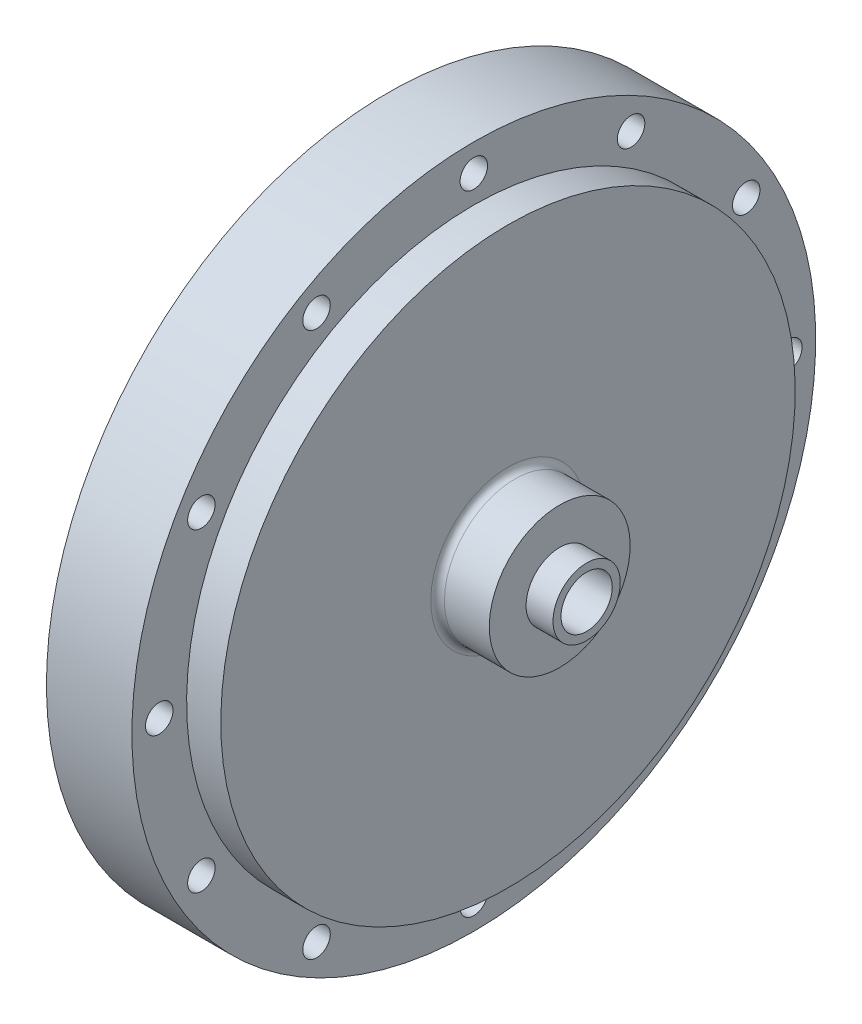
ISO-10303-21;
HEADER;
FILE_DESCRIPTION(('STEP AP214'),'2;1');
FILE_NAME('part.step','',(''),(''),'','','');
FILE_SCHEMA(('AUTOMOTIVE_DESIGN { 1 0 10303 214 1 1 1 1 }'));
ENDSEC;
DATA;
#1=APPLICATION_CONTEXT('core data for automotive mechanical design processes');
#2=APPLICATION_PROTOCOL_DEFINITION('international standard','automotive_design',2000,#1);
#3=PRODUCT_CONTEXT('',#1,'mechanical');
#4=PRODUCT('Part','Part','',(#3));
#5=PRODUCT_RELATED_PRODUCT_CATEGORY('part','',(#4));
#6=PRODUCT_DEFINITION_FORMATION('','',#4);
#7=PRODUCT_DEFINITION_CONTEXT('part definition',#1,'design');
#8=PRODUCT_DEFINITION('design','',#6,#7);
#9=PRODUCT_DEFINITION_SHAPE('','',#8);
#10=(LENGTH_UNIT() NAMED_UNIT(*) SI_UNIT(.MILLI.,.METRE.));
#11=(NAMED_UNIT(*) PLANE_ANGLE_UNIT() SI_UNIT($,.RADIAN.));
#12=(NAMED_UNIT(*) SI_UNIT($,.STERADIAN.) SOLID_ANGLE_UNIT());
#13=UNCERTAINTY_MEASURE_WITH_UNIT(LENGTH_MEASURE(1.E-05),#10,'distance_accuracy_value','');
#14=(GEOMETRIC_REPRESENTATION_CONTEXT(3) GLOBAL_UNCERTAINTY_ASSIGNED_CONTEXT((#13)) GLOBAL_UNIT_ASSIGNED_CONTEXT((#10,
#11,#12)) REPRESENTATION_CONTEXT('',''));
#15=CARTESIAN_POINT('',(0.,0.,0.));
#16=DIRECTION('',(0.,0.,1.));
#17=DIRECTION('',(1.,0.,0.));
#18=AXIS2_PLACEMENT_3D('',#15,#16,#17);
#19=CARTESIAN_POINT('',(31.75,63.5,0.));
#20=DIRECTION('',(-1.,0.,0.));
#21=DIRECTION('',(0.,-1.,0.));
#22=AXIS2_PLACEMENT_3D('',#19,#20,#21);
#23=PLANE('',#22);
#24=CARTESIAN_POINT('',(31.75,0.,0.));
#25=DIRECTION('',(-1.,0.,0.));
#26=DIRECTION('',(0.,-1.,0.));
#27=AXIS2_PLACEMENT_3D('',#24,#25,#26);
#28=CIRCLE('',#27,14.351);
#29=CARTESIAN_POINT('',(31.75,-14.351,0.));
#30=VERTEX_POINT('',#29);
#31=EDGE_CURVE('E210',#30,#30,#28,.T.);
#32=ORIENTED_EDGE('',*,*,#31,.T.);
#33=EDGE_LOOP('',(#32));
#34=FACE_BOUND('',#33,.T.);
#35=CARTESIAN_POINT('',(31.75,0.,0.));
#36=DIRECTION('',(1.,0.,0.));
#37=DIRECTION('',(0.,1.,0.));
#38=AXIS2_PLACEMENT_3D('',#35,#36,#37);
#39=CIRCLE('',#38,53.34);
#40=CARTESIAN_POINT('',(31.75,53.34,0.));
#41=VERTEX_POINT('',#40);
#42=EDGE_CURVE('E233',#41,#41,#39,.T.);
#43=ORIENTED_EDGE('',*,*,#42,.T.);
#44=EDGE_LOOP('',(#43));
#45=FACE_BOUND('',#44,.T.);
#46=ADVANCED_FACE('F48',(#34,#45),#23,.F.);
#47=CARTESIAN_POINT('',(9.525,0.,0.));
#48=DIRECTION('',(-1.,0.,0.));
#49=DIRECTION('',(0.,-1.,0.));
#50=AXIS2_PLACEMENT_3D('',#47,#48,#49);
#51=CYLINDRICAL_SURFACE('',#50,63.5);
#52=CARTESIAN_POINT('',(9.525,0.,0.));
#53=DIRECTION('',(-1.,0.,0.));
#54=DIRECTION('',(0.,-1.,0.));
#55=AXIS2_PLACEMENT_3D('',#52,#53,#54);
#56=CIRCLE('',#55,63.5);
#57=CARTESIAN_POINT('',(9.525,-63.5,0.));
#58=VERTEX_POINT('',#57);
#59=EDGE_CURVE('E418',#58,#58,#56,.T.);
#60=ORIENTED_EDGE('',*,*,#59,.F.);
#61=EDGE_LOOP('',(#60));
#62=FACE_BOUND('',#61,.T.);
#63=CARTESIAN_POINT('',(25.4,0.,0.));
#64=DIRECTION('',(1.,0.,0.));
#65=DIRECTION('',(0.,1.,0.));
#66=AXIS2_PLACEMENT_3D('',#63,#64,#65);
#67=CIRCLE('',#66,63.5);
#68=CARTESIAN_POINT('',(25.4,63.5,0.));
#69=VERTEX_POINT('',#68);
#70=EDGE_CURVE('E109',#69,#69,#67,.T.);
#71=ORIENTED_EDGE('',*,*,#70,.F.);
#72=EDGE_LOOP('',(#71));
#73=FACE_BOUND('',#72,.T.);
#74=ADVANCED_FACE('F229',(#62,#73),#51,.T.);
#75=CARTESIAN_POINT('',(31.75,-50.5932040890869,29.21));
#76=DIRECTION('',(1.,0.,0.));
#77=DIRECTION('',(0.,0.,-1.));
#78=AXIS2_PLACEMENT_3D('',#75,#76,#77);
#79=CYLINDRICAL_SURFACE('',#78,2.5527);
#80=CARTESIAN_POINT('',(9.525,-50.5932040890869,29.21));
#81=DIRECTION('',(1.,0.,0.));
#82=DIRECTION('',(0.,1.,0.));
#83=AXIS2_PLACEMENT_3D('',#80,#81,#82);
#84=CIRCLE('',#83,2.5527);
#85=CARTESIAN_POINT('',(9.525,-48.0405040890869,29.21));
#86=VERTEX_POINT('',#85);
#87=EDGE_CURVE('E410',#86,#86,#84,.T.);
#88=ORIENTED_EDGE('',*,*,#87,.F.);
#89=EDGE_LOOP('',(#88));
#90=FACE_BOUND('',#89,.T.);
#91=CARTESIAN_POINT('',(25.4,-50.5932040890869,29.21));
#92=DIRECTION('',(1.,0.,0.));
#93=DIRECTION('',(0.,1.,0.));
#94=AXIS2_PLACEMENT_3D('',#91,#92,#93);
#95=CIRCLE('',#94,2.5527);
#96=CARTESIAN_POINT('',(25.4,-48.0405040890869,29.21));
#97=VERTEX_POINT('',#96);
#98=EDGE_CURVE('E282',#97,#97,#95,.F.);
#99=ORIENTED_EDGE('',*,*,#98,.F.);
#100=EDGE_LOOP('',(#99));
#101=FACE_BOUND('',#100,.T.);
#102=ADVANCED_FACE('F291',(#90,#101),#79,.F.);
#103=CARTESIAN_POINT('',(31.75,-29.21,50.5932040890869));
#104=DIRECTION('',(1.,0.,0.));
#105=DIRECTION('',(0.,0.,-1.));
#106=AXIS2_PLACEMENT_3D('',#103,#104,#105);
#107=CYLINDRICAL_SURFACE('',#106,2.5527);
#108=CARTESIAN_POINT('',(9.525,-29.21,50.5932040890869));
#109=DIRECTION('',(1.,0.,0.));
#110=DIRECTION('',(0.,1.,0.));
#111=AXIS2_PLACEMENT_3D('',#108,#109,#110);
#112=CIRCLE('',#111,2.5527);
#113=CARTESIAN_POINT('',(9.525,-26.6573,50.5932040890869));
#114=VERTEX_POINT('',#113);
#115=EDGE_CURVE('E406',#114,#114,#112,.T.);
#116=ORIENTED_EDGE('',*,*,#115,.F.);
#117=EDGE_LOOP('',(#116));
#118=FACE_BOUND('',#117,.T.);
#119=CARTESIAN_POINT('',(25.4,-29.21,50.5932040890869));
#120=DIRECTION('',(1.,0.,0.));
#121=DIRECTION('',(0.,1.,0.));
#122=AXIS2_PLACEMENT_3D('',#119,#120,#121);
#123=CIRCLE('',#122,2.5527);
#124=CARTESIAN_POINT('',(25.4,-26.6573,50.5932040890869));
#125=VERTEX_POINT('',#124);
#126=EDGE_CURVE('E278',#125,#125,#123,.F.);
#127=ORIENTED_EDGE('',*,*,#126,.F.);
#128=EDGE_LOOP('',(#127));
#129=FACE_BOUND('',#128,.T.);
#130=ADVANCED_FACE('F296',(#118,#129),#107,.F.);
#131=CARTESIAN_POINT('',(31.75,0.,58.42));
#132=DIRECTION('',(1.,0.,0.));
#133=DIRECTION('',(0.,0.,-1.));
#134=AXIS2_PLACEMENT_3D('',#131,#132,#133);
#135=CYLINDRICAL_SURFACE('',#134,2.5527);
#136=CARTESIAN_POINT('',(9.525,0.,58.42));
#137=DIRECTION('',(1.,0.,0.));
#138=DIRECTION('',(0.,1.,0.));
#139=AXIS2_PLACEMENT_3D('',#136,#137,#138);
#140=CIRCLE('',#139,2.5527);
#141=CARTESIAN_POINT('',(9.525,2.5527,58.42));
#142=VERTEX_POINT('',#141);
#143=EDGE_CURVE('E402',#142,#142,#140,.T.);
#144=ORIENTED_EDGE('',*,*,#143,.F.);
#145=EDGE_LOOP('',(#144));
#146=FACE_BOUND('',#145,.T.);
#147=CARTESIAN_POINT('',(25.4,0.,58.42));
#148=DIRECTION('',(1.,0.,0.));
#149=DIRECTION('',(0.,1.,0.));
#150=AXIS2_PLACEMENT_3D('',#147,#148,#149);
#151=CIRCLE('',#150,2.5527);
#152=CARTESIAN_POINT('',(25.4,2.5527,58.42));
#153=VERTEX_POINT('',#152);
#154=EDGE_CURVE('E274',#153,#153,#151,.F.);
#155=ORIENTED_EDGE('',*,*,#154,.F.);
#156=EDGE_LOOP('',(#155));
#157=FACE_BOUND('',#156,.T.);
#158=ADVANCED_FACE('F826',(#146,#157),#135,.F.);
#159=CARTESIAN_POINT('',(31.75,29.21,50.5932040890869));
#160=DIRECTION('',(1.,0.,0.));
#161=DIRECTION('',(0.,0.,-1.));
#162=AXIS2_PLACEMENT_3D('',#159,#160,#161);
#163=CYLINDRICAL_SURFACE('',#162,2.5527);
#164=CARTESIAN_POINT('',(9.525,29.21,50.5932040890869));
#165=DIRECTION('',(1.,0.,0.));
#166=DIRECTION('',(0.,1.,0.));
#167=AXIS2_PLACEMENT_3D('',#164,#165,#166);
#168=CIRCLE('',#167,2.5527);
#169=CARTESIAN_POINT('',(9.525,31.7627,50.5932040890869));
#170=VERTEX_POINT('',#169);
#171=EDGE_CURVE('E398',#170,#170,#168,.T.);
#172=ORIENTED_EDGE('',*,*,#171,.F.);
#173=EDGE_LOOP('',(#172));
#174=FACE_BOUND('',#173,.T.);
#175=CARTESIAN_POINT('',(25.4,29.21,50.5932040890869));
#176=DIRECTION('',(1.,0.,0.));
#177=DIRECTION('',(0.,1.,0.));
#178=AXIS2_PLACEMENT_3D('',#175,#176,#177);
#179=CIRCLE('',#178,2.5527);
#180=CARTESIAN_POINT('',(25.4,31.7627,50.5932040890869));
#181=VERTEX_POINT('',#180);
#182=EDGE_CURVE('E270',#181,#181,#179,.F.);
#183=ORIENTED_EDGE('',*,*,#182,.F.);
#184=EDGE_LOOP('',(#183));
#185=FACE_BOUND('',#184,.T.);
#186=ADVANCED_FACE('F834',(#174,#185),#163,.F.);
#187=CARTESIAN_POINT('',(31.75,50.5932040890869,29.21));
#188=DIRECTION('',(1.,0.,0.));
#189=DIRECTION('',(0.,0.,-1.));
#190=AXIS2_PLACEMENT_3D('',#187,#188,#189);
#191=CYLINDRICAL_SURFACE('',#190,2.5527);
#192=CARTESIAN_POINT('',(9.525,50.5932040890869,29.21));
#193=DIRECTION('',(1.,0.,0.));
#194=DIRECTION('',(0.,1.,0.));
#195=AXIS2_PLACEMENT_3D('',#192,#193,#194);
#196=CIRCLE('',#195,2.5527);
#197=CARTESIAN_POINT('',(9.525,53.1459040890869,29.21));
#198=VERTEX_POINT('',#197);
#199=EDGE_CURVE('E394',#198,#198,#196,.T.);
#200=ORIENTED_EDGE('',*,*,#199,.F.);
#201=EDGE_LOOP('',(#200));
#202=FACE_BOUND('',#201,.T.);
#203=CARTESIAN_POINT('',(25.4,50.5932040890869,29.21));
#204=DIRECTION('',(1.,0.,0.));
#205=DIRECTION('',(0.,1.,0.));
#206=AXIS2_PLACEMENT_3D('',#203,#204,#205);
#207=CIRCLE('',#206,2.5527);
#208=CARTESIAN_POINT('',(25.4,53.1459040890869,29.21));
#209=VERTEX_POINT('',#208);
#210=EDGE_CURVE('E266',#209,#209,#207,.F.);
#211=ORIENTED_EDGE('',*,*,#210,.F.);
#212=EDGE_LOOP('',(#211));
#213=FACE_BOUND('',#212,.T.);
#214=ADVANCED_FACE('F843',(#202,#213),#191,.F.);
#215=CARTESIAN_POINT('',(31.75,58.42,0.));
#216=DIRECTION('',(1.,0.,0.));
#217=DIRECTION('',(0.,0.,-1.));
#218=AXIS2_PLACEMENT_3D('',#215,#216,#217);
#219=CYLINDRICAL_SURFACE('',#218,2.5527);
#220=CARTESIAN_POINT('',(9.525,58.42,0.));
#221=DIRECTION('',(1.,0.,0.));
#222=DIRECTION('',(0.,1.,0.));
#223=AXIS2_PLACEMENT_3D('',#220,#221,#222);
#224=CIRCLE('',#223,2.5527);
#225=CARTESIAN_POINT('',(9.525,60.9727,0.));
#226=VERTEX_POINT('',#225);
#227=EDGE_CURVE('E390',#226,#226,#224,.T.);
#228=ORIENTED_EDGE('',*,*,#227,.F.);
#229=EDGE_LOOP('',(#228));
#230=FACE_BOUND('',#229,.T.);
#231=CARTESIAN_POINT('',(25.4,58.42,0.));
#232=DIRECTION('',(1.,0.,0.));
#233=DIRECTION('',(0.,1.,0.));
#234=AXIS2_PLACEMENT_3D('',#231,#232,#233);
#235=CIRCLE('',#234,2.5527);
#236=CARTESIAN_POINT('',(25.4,60.9727,0.));
#237=VERTEX_POINT('',#236);
#238=EDGE_CURVE('E262',#237,#237,#235,.F.);
#239=ORIENTED_EDGE('',*,*,#238,.F.);
#240=EDGE_LOOP('',(#239));
#241=FACE_BOUND('',#240,.T.);
#242=ADVANCED_FACE('F852',(#230,#241),#219,.F.);
#243=CARTESIAN_POINT('',(31.75,50.5932040890869,-29.21));
#244=DIRECTION('',(1.,0.,0.));
#245=DIRECTION('',(0.,0.,-1.));
#246=AXIS2_PLACEMENT_3D('',#243,#244,#245);
#247=CYLINDRICAL_SURFACE('',#246,2.5527);
#248=CARTESIAN_POINT('',(9.525,50.5932040890869,-29.21));
#249=DIRECTION('',(1.,0.,0.));
#250=DIRECTION('',(0.,1.,0.));
#251=AXIS2_PLACEMENT_3D('',#248,#249,#250);
#252=CIRCLE('',#251,2.5527);
#253=CARTESIAN_POINT('',(9.525,53.1459040890869,-29.21));
#254=VERTEX_POINT('',#253);
#255=EDGE_CURVE('E386',#254,#254,#252,.T.);
#256=ORIENTED_EDGE('',*,*,#255,.F.);
#257=EDGE_LOOP('',(#256));
#258=FACE_BOUND('',#257,.T.);
#259=CARTESIAN_POINT('',(25.4,50.5932040890869,-29.21));
#260=DIRECTION('',(1.,0.,0.));
#261=DIRECTION('',(0.,1.,0.));
#262=AXIS2_PLACEMENT_3D('',#259,#260,#261);
#263=CIRCLE('',#262,2.5527);
#264=CARTESIAN_POINT('',(25.4,53.1459040890869,-29.21));
#265=VERTEX_POINT('',#264);
#266=EDGE_CURVE('E258',#265,#265,#263,.F.);
#267=ORIENTED_EDGE('',*,*,#266,.F.);
#268=EDGE_LOOP('',(#267));
#269=FACE_BOUND('',#268,.T.);
#270=ADVANCED_FACE('F861',(#258,#269),#247,.F.);
#271=CARTESIAN_POINT('',(31.75,29.21,-50.5932040890869));
#272=DIRECTION('',(1.,0.,0.));
#273=DIRECTION('',(0.,0.,-1.));
#274=AXIS2_PLACEMENT_3D('',#271,#272,#273);
#275=CYLINDRICAL_SURFACE('',#274,2.55269999999999);
#276=CARTESIAN_POINT('',(9.525,29.21,-50.5932040890869));
#277=DIRECTION('',(1.,0.,0.));
#278=DIRECTION('',(0.,1.,0.));
#279=AXIS2_PLACEMENT_3D('',#276,#277,#278);
#280=CIRCLE('',#279,2.55269999999999);
#281=CARTESIAN_POINT('',(9.525,31.7627,-50.5932040890869));
#282=VERTEX_POINT('',#281);
#283=EDGE_CURVE('E382',#282,#282,#280,.T.);
#284=ORIENTED_EDGE('',*,*,#283,.F.);
#285=EDGE_LOOP('',(#284));
#286=FACE_BOUND('',#285,.T.);
#287=CARTESIAN_POINT('',(25.4,29.21,-50.5932040890869));
#288=DIRECTION('',(1.,0.,0.));
#289=DIRECTION('',(0.,1.,0.));
#290=AXIS2_PLACEMENT_3D('',#287,#288,#289);
#291=CIRCLE('',#290,2.55269999999999);
#292=CARTESIAN_POINT('',(25.4,31.7627,-50.5932040890869));
#293=VERTEX_POINT('',#292);
#294=EDGE_CURVE('E254',#293,#293,#291,.F.);
#295=ORIENTED_EDGE('',*,*,#294,.F.);
#296=EDGE_LOOP('',(#295));
#297=FACE_BOUND('',#296,.T.);
#298=ADVANCED_FACE('F870',(#286,#297),#275,.F.);
#299=CARTESIAN_POINT('',(31.75,0.,-58.42));
#300=DIRECTION('',(1.,0.,0.));
#301=DIRECTION('',(0.,0.,-1.));
#302=AXIS2_PLACEMENT_3D('',#299,#300,#301);
#303=CYLINDRICAL_SURFACE('',#302,2.5527);
#304=CARTESIAN_POINT('',(9.525,0.,-58.42));
#305=DIRECTION('',(1.,0.,0.));
#306=DIRECTION('',(0.,1.,0.));
#307=AXIS2_PLACEMENT_3D('',#304,#305,#306);
#308=CIRCLE('',#307,2.5527);
#309=CARTESIAN_POINT('',(9.525,2.5527,-58.42));
#310=VERTEX_POINT('',#309);
#311=EDGE_CURVE('E378',#310,#310,#308,.T.);
#312=ORIENTED_EDGE('',*,*,#311,.F.);
#313=EDGE_LOOP('',(#312));
#314=FACE_BOUND('',#313,.T.);
#315=CARTESIAN_POINT('',(25.4,0.,-58.42));
#316=DIRECTION('',(1.,0.,0.));
#317=DIRECTION('',(0.,1.,0.));
#318=AXIS2_PLACEMENT_3D('',#315,#316,#317);
#319=CIRCLE('',#318,2.5527);
#320=CARTESIAN_POINT('',(25.4,2.5527,-58.42));
#321=VERTEX_POINT('',#320);
#322=EDGE_CURVE('E250',#321,#321,#319,.F.);
#323=ORIENTED_EDGE('',*,*,#322,.F.);
#324=EDGE_LOOP('',(#323));
#325=FACE_BOUND('',#324,.T.);
#326=ADVANCED_FACE('F879',(#314,#325),#303,.F.);
#327=CARTESIAN_POINT('',(31.75,-29.21,-50.5932040890869));
#328=DIRECTION('',(1.,0.,0.));
#329=DIRECTION('',(0.,0.,-1.));
#330=AXIS2_PLACEMENT_3D('',#327,#328,#329);
#331=CYLINDRICAL_SURFACE('',#330,2.5527);
#332=CARTESIAN_POINT('',(9.525,-29.21,-50.5932040890869));
#333=DIRECTION('',(1.,0.,0.));
#334=DIRECTION('',(0.,1.,0.));
#335=AXIS2_PLACEMENT_3D('',#332,#333,#334);
#336=CIRCLE('',#335,2.5527);
#337=CARTESIAN_POINT('',(9.525,-26.6573,-50.5932040890869));
#338=VERTEX_POINT('',#337);
#339=EDGE_CURVE('E374',#338,#338,#336,.T.);
#340=ORIENTED_EDGE('',*,*,#339,.F.);
#341=EDGE_LOOP('',(#340));
#342=FACE_BOUND('',#341,.T.);
#343=CARTESIAN_POINT('',(25.4,-29.21,-50.5932040890869));
#344=DIRECTION('',(1.,0.,0.));
#345=DIRECTION('',(0.,1.,0.));
#346=AXIS2_PLACEMENT_3D('',#343,#344,#345);
#347=CIRCLE('',#346,2.5527);
#348=CARTESIAN_POINT('',(25.4,-26.6573,-50.5932040890869));
#349=VERTEX_POINT('',#348);
#350=EDGE_CURVE('E246',#349,#349,#347,.F.);
#351=ORIENTED_EDGE('',*,*,#350,.F.);
#352=EDGE_LOOP('',(#351));
#353=FACE_BOUND('',#352,.T.);
#354=ADVANCED_FACE('F888',(#342,#353),#331,.F.);
#355=CARTESIAN_POINT('',(31.75,-50.5932040890869,-29.21));
#356=DIRECTION('',(1.,0.,0.));
#357=DIRECTION('',(0.,0.,-1.));
#358=AXIS2_PLACEMENT_3D('',#355,#356,#357);
#359=CYLINDRICAL_SURFACE('',#358,2.5527);
#360=CARTESIAN_POINT('',(9.525,-50.5932040890869,-29.21));
#361=DIRECTION('',(1.,0.,0.));
#362=DIRECTION('',(0.,1.,0.));
#363=AXIS2_PLACEMENT_3D('',#360,#361,#362);
#364=CIRCLE('',#363,2.5527);
#365=CARTESIAN_POINT('',(9.525,-48.0405040890869,-29.21));
#366=VERTEX_POINT('',#365);
#367=EDGE_CURVE('E370',#366,#366,#364,.T.);
#368=ORIENTED_EDGE('',*,*,#367,.F.);
#369=EDGE_LOOP('',(#368));
#370=FACE_BOUND('',#369,.T.);
#371=CARTESIAN_POINT('',(25.4,-50.5932040890869,-29.21));
#372=DIRECTION('',(1.,0.,0.));
#373=DIRECTION('',(0.,1.,0.));
#374=AXIS2_PLACEMENT_3D('',#371,#372,#373);
#375=CIRCLE('',#374,2.5527);
#376=CARTESIAN_POINT('',(25.4,-48.0405040890869,-29.21));
#377=VERTEX_POINT('',#376);
#378=EDGE_CURVE('E242',#377,#377,#375,.F.);
#379=ORIENTED_EDGE('',*,*,#378,.F.);
#380=EDGE_LOOP('',(#379));
#381=FACE_BOUND('',#380,.T.);
#382=ADVANCED_FACE('F897',(#370,#381),#359,.F.);
#383=CARTESIAN_POINT('',(31.75,-58.42,0.));
#384=DIRECTION('',(1.,0.,0.));
#385=DIRECTION('',(0.,0.,-1.));
#386=AXIS2_PLACEMENT_3D('',#383,#384,#385);
#387=CYLINDRICAL_SURFACE('',#386,2.5527);
#388=CARTESIAN_POINT('',(9.525,-58.42,0.));
#389=DIRECTION('',(1.,0.,0.));
#390=DIRECTION('',(0.,1.,0.));
#391=AXIS2_PLACEMENT_3D('',#388,#389,#390);
#392=CIRCLE('',#391,2.5527);
#393=CARTESIAN_POINT('',(9.525,-55.8673,0.));
#394=VERTEX_POINT('',#393);
#395=EDGE_CURVE('E366',#394,#394,#392,.T.);
#396=ORIENTED_EDGE('',*,*,#395,.F.);
#397=EDGE_LOOP('',(#396));
#398=FACE_BOUND('',#397,.T.);
#399=CARTESIAN_POINT('',(25.4,-58.42,0.));
#400=DIRECTION('',(1.,0.,0.));
#401=DIRECTION('',(0.,1.,0.));
#402=AXIS2_PLACEMENT_3D('',#399,#400,#401);
#403=CIRCLE('',#402,2.5527);
#404=CARTESIAN_POINT('',(25.4,-55.8673,0.));
#405=VERTEX_POINT('',#404);
#406=EDGE_CURVE('E52',#405,#405,#403,.F.);
#407=ORIENTED_EDGE('',*,*,#406,.F.);
#408=EDGE_LOOP('',(#407));
#409=FACE_BOUND('',#408,.T.);
#410=ADVANCED_FACE('F440',(#398,#409),#387,.F.);
#411=CARTESIAN_POINT('',(9.525,0.,0.));
#412=DIRECTION('',(1.,0.,0.));
#413=DIRECTION('',(0.,1.,0.));
#414=AXIS2_PLACEMENT_3D('',#411,#412,#413);
#415=PLANE('',#414);
#416=ORIENTED_EDGE('',*,*,#59,.T.);
#417=EDGE_LOOP('',(#416));
#418=FACE_BOUND('',#417,.T.);
#419=ORIENTED_EDGE('',*,*,#87,.T.);
#420=EDGE_LOOP('',(#419));
#421=FACE_BOUND('',#420,.T.);
#422=ORIENTED_EDGE('',*,*,#115,.T.);
#423=EDGE_LOOP('',(#422));
#424=FACE_BOUND('',#423,.T.);
#425=ORIENTED_EDGE('',*,*,#143,.T.);
#426=EDGE_LOOP('',(#425));
#427=FACE_BOUND('',#426,.T.);
#428=ORIENTED_EDGE('',*,*,#171,.T.);
#429=EDGE_LOOP('',(#428));
#430=FACE_BOUND('',#429,.T.);
#431=ORIENTED_EDGE('',*,*,#199,.T.);
#432=EDGE_LOOP('',(#431));
#433=FACE_BOUND('',#432,.T.);
#434=ORIENTED_EDGE('',*,*,#227,.T.);
#435=EDGE_LOOP('',(#434));
#436=FACE_BOUND('',#435,.T.);
#437=ORIENTED_EDGE('',*,*,#255,.T.);
#438=EDGE_LOOP('',(#437));
#439=FACE_BOUND('',#438,.T.);
#440=ORIENTED_EDGE('',*,*,#283,.T.);
#441=EDGE_LOOP('',(#440));
#442=FACE_BOUND('',#441,.T.);
#443=ORIENTED_EDGE('',*,*,#311,.T.);
#444=EDGE_LOOP('',(#443));
#445=FACE_BOUND('',#444,.T.);
#446=ORIENTED_EDGE('',*,*,#339,.T.);
#447=EDGE_LOOP('',(#446));
#448=FACE_BOUND('',#447,.T.);
#449=ORIENTED_EDGE('',*,*,#367,.T.);
#450=EDGE_LOOP('',(#449));
#451=FACE_BOUND('',#450,.T.);
#452=ORIENTED_EDGE('',*,*,#395,.T.);
#453=EDGE_LOOP('',(#452));
#454=FACE_BOUND('',#453,.T.);
#455=CARTESIAN_POINT('',(9.525,15.120208614887,-56.429386771808));
#456=DIRECTION('',(-1.,0.,0.));
#457=DIRECTION('',(0.,0.,1.));
#458=AXIS2_PLACEMENT_3D('',#455,#456,#457);
#459=CIRCLE('',#458,2.38125);
#460=CARTESIAN_POINT('',(9.525,15.120208614887,-54.048136771808));
#461=VERTEX_POINT('',#460);
#462=EDGE_CURVE('E358',#461,#461,#459,.T.);
#463=ORIENTED_EDGE('',*,*,#462,.F.);
#464=EDGE_LOOP('',(#463));
#465=FACE_BOUND('',#464,.T.);
#466=CARTESIAN_POINT('',(9.525,-15.1202086148874,56.4293867718079));
#467=DIRECTION('',(-1.,0.,0.));
#468=DIRECTION('',(0.,0.,1.));
#469=AXIS2_PLACEMENT_3D('',#466,#467,#468);
#470=CIRCLE('',#469,2.38125);
#471=CARTESIAN_POINT('',(9.525,-15.1202086148874,58.8106367718079));
#472=VERTEX_POINT('',#471);
#473=EDGE_CURVE('E346',#472,#472,#470,.T.);
#474=ORIENTED_EDGE('',*,*,#473,.F.);
#475=EDGE_LOOP('',(#474));
#476=FACE_BOUND('',#475,.T.);
#477=CARTESIAN_POINT('',(9.525,0.,0.));
#478=DIRECTION('',(1.,0.,0.));
#479=DIRECTION('',(0.,1.,0.));
#480=AXIS2_PLACEMENT_3D('',#477,#478,#479);
#481=CIRCLE('',#480,44.45);
#482=CARTESIAN_POINT('',(9.525,44.45,0.));
#483=VERTEX_POINT('',#482);
#484=EDGE_CURVE('E13',#483,#483,#481,.F.);
#485=ORIENTED_EDGE('',*,*,#484,.F.);
#486=EDGE_LOOP('',(#485));
#487=FACE_BOUND('',#486,.T.);
#488=ADVANCED_FACE('F320',(#418,#421,#424,#427,#430,#433,#436,#439,#442,#445,#448,#451,#454,
#465,#476,#487),#415,.F.);
#489=ORIENTED_EDGE('',*,*,#484,.T.);
#490=EDGE_LOOP('',(#489));
#491=FACE_BOUND('',#490,.T.);
#492=CARTESIAN_POINT('',(9.525,23.5731723178062,23.5731723178068));
#493=DIRECTION('',(-1.,0.,0.));
#494=DIRECTION('',(0.,0.,1.));
#495=AXIS2_PLACEMENT_3D('',#492,#493,#494);
#496=CIRCLE('',#495,1.13029999999999);
#497=CARTESIAN_POINT('',(9.525,23.5731723178062,24.7034723178068));
#498=VERTEX_POINT('',#497);
#499=EDGE_CURVE('E101',#498,#498,#496,.T.);
#500=ORIENTED_EDGE('',*,*,#499,.F.);
#501=EDGE_LOOP('',(#500));
#502=FACE_BOUND('',#501,.T.);
#503=CARTESIAN_POINT('',(9.525,33.3375,3.49191777401049E-13));
#504=DIRECTION('',(-1.,0.,0.));
#505=DIRECTION('',(0.,0.,1.));
#506=AXIS2_PLACEMENT_3D('',#503,#504,#505);
#507=CIRCLE('',#506,1.13029999999999);
#508=CARTESIAN_POINT('',(9.525,33.3375,1.13030000000034));
#509=VERTEX_POINT('',#508);
#510=EDGE_CURVE('E100',#509,#509,#507,.T.);
#511=ORIENTED_EDGE('',*,*,#510,.F.);
#512=EDGE_LOOP('',(#511));
#513=FACE_BOUND('',#512,.T.);
#514=CARTESIAN_POINT('',(9.525,0.,-33.3375));
#515=DIRECTION('',(-1.,0.,0.));
#516=DIRECTION('',(0.,0.,1.));
#517=AXIS2_PLACEMENT_3D('',#514,#515,#516);
#518=CIRCLE('',#517,1.13029999999999);
#519=CARTESIAN_POINT('',(9.525,0.,-32.2072));
#520=VERTEX_POINT('',#519);
#521=EDGE_CURVE('E124',#520,#520,#518,.T.);
#522=ORIENTED_EDGE('',*,*,#521,.F.);
#523=EDGE_LOOP('',(#522));
#524=FACE_BOUND('',#523,.T.);
#525=CARTESIAN_POINT('',(9.525,-23.5731723178064,-23.5731723178067));
#526=DIRECTION('',(-1.,0.,0.));
#527=DIRECTION('',(0.,0.,1.));
#528=AXIS2_PLACEMENT_3D('',#525,#526,#527);
#529=CIRCLE('',#528,1.13029999999999);
#530=CARTESIAN_POINT('',(9.525,-23.5731723178064,-22.4428723178067));
#531=VERTEX_POINT('',#530);
#532=EDGE_CURVE('E132',#531,#531,#529,.T.);
#533=ORIENTED_EDGE('',*,*,#532,.F.);
#534=EDGE_LOOP('',(#533));
#535=FACE_BOUND('',#534,.T.);
#536=CARTESIAN_POINT('',(9.525,-33.3375,-1.16397259133683E-13));
#537=DIRECTION('',(-1.,0.,0.));
#538=DIRECTION('',(0.,0.,1.));
#539=AXIS2_PLACEMENT_3D('',#536,#537,#538);
#540=CIRCLE('',#539,1.13029999999999);
#541=CARTESIAN_POINT('',(9.525,-33.3375,1.13029999999987));
#542=VERTEX_POINT('',#541);
#543=EDGE_CURVE('E140',#542,#542,#540,.T.);
#544=ORIENTED_EDGE('',*,*,#543,.F.);
#545=EDGE_LOOP('',(#544));
#546=FACE_BOUND('',#545,.T.);
#547=CARTESIAN_POINT('',(9.525,-23.5731723178066,23.5731723178065));
#548=DIRECTION('',(-1.,0.,0.));
#549=DIRECTION('',(0.,0.,1.));
#550=AXIS2_PLACEMENT_3D('',#547,#548,#549);
#551=CIRCLE('',#550,1.13029999999999);
#552=CARTESIAN_POINT('',(9.525,-23.5731723178066,24.7034723178065));
#553=VERTEX_POINT('',#552);
#554=EDGE_CURVE('E148',#553,#553,#551,.T.);
#555=ORIENTED_EDGE('',*,*,#554,.F.);
#556=EDGE_LOOP('',(#555));
#557=FACE_BOUND('',#556,.T.);
#558=CARTESIAN_POINT('',(9.525,0.,33.3375));
#559=DIRECTION('',(-1.,0.,0.));
#560=DIRECTION('',(0.,0.,1.));
#561=AXIS2_PLACEMENT_3D('',#558,#559,#560);
#562=CIRCLE('',#561,1.13029999999999);
#563=CARTESIAN_POINT('',(9.525,0.,34.4678));
#564=VERTEX_POINT('',#563);
#565=EDGE_CURVE('E156',#564,#564,#562,.T.);
#566=ORIENTED_EDGE('',*,*,#565,.F.);
#567=EDGE_LOOP('',(#566));
#568=FACE_BOUND('',#567,.T.);
#569=CARTESIAN_POINT('',(9.525,0.,0.));
#570=DIRECTION('',(-1.,0.,0.));
#571=DIRECTION('',(0.,-1.,0.));
#572=AXIS2_PLACEMENT_3D('',#569,#570,#571);
#573=CIRCLE('',#572,28.575);
#574=CARTESIAN_POINT('',(9.525,-28.575,0.));
#575=VERTEX_POINT('',#574);
#576=EDGE_CURVE('E343',#575,#575,#573,.T.);
#577=ORIENTED_EDGE('',*,*,#576,.F.);
#578=EDGE_LOOP('',(#577));
#579=FACE_BOUND('',#578,.T.);
#580=CARTESIAN_POINT('',(9.525,23.5731723178067,-23.5731723178063));
#581=DIRECTION('',(-1.,0.,0.));
#582=DIRECTION('',(0.,0.,1.));
#583=AXIS2_PLACEMENT_3D('',#580,#581,#582);
#584=CIRCLE('',#583,1.13029999999999);
#585=CARTESIAN_POINT('',(9.525,23.5731723178067,-22.4428723178063));
#586=VERTEX_POINT('',#585);
#587=EDGE_CURVE('E116',#586,#586,#584,.T.);
#588=ORIENTED_EDGE('',*,*,#587,.F.);
#589=EDGE_LOOP('',(#588));
#590=FACE_BOUND('',#589,.T.);
#591=ADVANCED_FACE('F317',(#491,#502,#513,#524,#535,#546,#557,#568,#579,#590),#415,.F.);
#592=CARTESIAN_POINT('',(9.525,0.,0.));
#593=DIRECTION('',(1.,0.,0.));
#594=DIRECTION('',(0.,0.,-1.));
#595=AXIS2_PLACEMENT_3D('',#592,#593,#594);
#596=CYLINDRICAL_SURFACE('',#595,4.7625);
#597=CARTESIAN_POINT('',(30.48,0.,0.));
#598=DIRECTION('',(-1.,0.,0.));
#599=DIRECTION('',(0.,-1.,0.));
#600=AXIS2_PLACEMENT_3D('',#597,#598,#599);
#601=CIRCLE('',#600,4.7625);
#602=CARTESIAN_POINT('',(30.48,-4.7625,0.));
#603=VERTEX_POINT('',#602);
#604=EDGE_CURVE('E201',#603,#603,#601,.T.);
#605=ORIENTED_EDGE('',*,*,#604,.T.);
#606=EDGE_LOOP('',(#605));
#607=FACE_BOUND('',#606,.T.);
#608=CARTESIAN_POINT('',(46.355,0.,0.));
#609=DIRECTION('',(1.,0.,0.));
#610=DIRECTION('',(0.,0.,-1.));
#611=AXIS2_PLACEMENT_3D('',#608,#609,#610);
#612=CIRCLE('',#611,4.7625);
#613=CARTESIAN_POINT('',(46.355,0.,-4.7625));
#614=VERTEX_POINT('',#613);
#615=EDGE_CURVE('E414',#614,#614,#612,.T.);
#616=ORIENTED_EDGE('',*,*,#615,.T.);
#617=EDGE_LOOP('',(#616));
#618=FACE_BOUND('',#617,.T.);
#619=ADVANCED_FACE('F304',(#607,#618),#596,.F.);
#620=CARTESIAN_POINT('',(9.525,0.,0.));
#621=DIRECTION('',(-1.,0.,0.));
#622=DIRECTION('',(0.,-1.,0.));
#623=AXIS2_PLACEMENT_3D('',#620,#621,#622);
#624=CYLINDRICAL_SURFACE('',#623,13.081);
#625=CARTESIAN_POINT('',(33.02,0.,0.));
#626=DIRECTION('',(-1.,0.,0.));
#627=DIRECTION('',(0.,-1.,0.));
#628=AXIS2_PLACEMENT_3D('',#625,#626,#627);
#629=CIRCLE('',#628,13.081);
#630=CARTESIAN_POINT('',(33.02,-13.081,0.));
#631=VERTEX_POINT('',#630);
#632=EDGE_CURVE('E58',#631,#631,#629,.F.);
#633=ORIENTED_EDGE('',*,*,#632,.T.);
#634=EDGE_LOOP('',(#633));
#635=FACE_BOUND('',#634,.T.);
#636=CARTESIAN_POINT('',(41.355,0.,0.));
#637=DIRECTION('',(-1.,0.,0.));
#638=DIRECTION('',(0.,-1.,0.));
#639=AXIS2_PLACEMENT_3D('',#636,#637,#638);
#640=CIRCLE('',#639,13.081);
#641=CARTESIAN_POINT('',(41.355,-13.081,0.));
#642=VERTEX_POINT('',#641);
#643=EDGE_CURVE('E214',#642,#642,#640,.T.);
#644=ORIENTED_EDGE('',*,*,#643,.T.);
#645=EDGE_LOOP('',(#644));
#646=FACE_BOUND('',#645,.T.);
#647=ADVANCED_FACE('F219',(#635,#646),#624,.T.);
#648=CARTESIAN_POINT('',(41.355,13.081,0.));
#649=DIRECTION('',(-1.,0.,0.));
#650=DIRECTION('',(0.,-1.,0.));
#651=AXIS2_PLACEMENT_3D('',#648,#649,#650);
#652=PLANE('',#651);
#653=ORIENTED_EDGE('',*,*,#643,.F.);
#654=EDGE_LOOP('',(#653));
#655=FACE_BOUND('',#654,.T.);
#656=CARTESIAN_POINT('',(41.355,0.,0.));
#657=DIRECTION('',(-1.,0.,0.));
#658=DIRECTION('',(0.,-1.,0.));
#659=AXIS2_PLACEMENT_3D('',#656,#657,#658);
#660=CIRCLE('',#659,6.2484);
#661=CARTESIAN_POINT('',(41.355,-6.2484,0.));
#662=VERTEX_POINT('',#661);
#663=EDGE_CURVE('E426',#662,#662,#660,.T.);
#664=ORIENTED_EDGE('',*,*,#663,.T.);
#665=EDGE_LOOP('',(#664));
#666=FACE_BOUND('',#665,.T.);
#667=ADVANCED_FACE('F303',(#655,#666),#652,.F.);
#668=CARTESIAN_POINT('',(9.525,0.,0.));
#669=DIRECTION('',(-1.,0.,0.));
#670=DIRECTION('',(0.,-1.,0.));
#671=AXIS2_PLACEMENT_3D('',#668,#669,#670);
#672=CYLINDRICAL_SURFACE('',#671,6.2484);
#673=ORIENTED_EDGE('',*,*,#663,.F.);
#674=EDGE_LOOP('',(#673));
#675=FACE_BOUND('',#674,.T.);
#676=CARTESIAN_POINT('',(46.355,0.,0.));
#677=DIRECTION('',(-1.,0.,0.));
#678=DIRECTION('',(0.,-1.,0.));
#679=AXIS2_PLACEMENT_3D('',#676,#677,#678);
#680=CIRCLE('',#679,6.2484);
#681=CARTESIAN_POINT('',(46.355,-6.2484,0.));
#682=VERTEX_POINT('',#681);
#683=EDGE_CURVE('E422',#682,#682,#680,.T.);
#684=ORIENTED_EDGE('',*,*,#683,.T.);
#685=EDGE_LOOP('',(#684));
#686=FACE_BOUND('',#685,.T.);
#687=ADVANCED_FACE('F307',(#675,#686),#672,.T.);
#688=CARTESIAN_POINT('',(46.355,6.2484,0.));
#689=DIRECTION('',(-1.,0.,0.));
#690=DIRECTION('',(0.,-1.,0.));
#691=AXIS2_PLACEMENT_3D('',#688,#689,#690);
#692=PLANE('',#691);
#693=ORIENTED_EDGE('',*,*,#615,.F.);
#694=EDGE_LOOP('',(#693));
#695=FACE_BOUND('',#694,.T.);
#696=ORIENTED_EDGE('',*,*,#683,.F.);
#697=EDGE_LOOP('',(#696));
#698=FACE_BOUND('',#697,.T.);
#699=ADVANCED_FACE('F311',(#695,#698),#692,.F.);
#700=CARTESIAN_POINT('',(15.875,15.120208614887,-56.429386771808));
#701=DIRECTION('',(-1.,0.,0.));
#702=DIRECTION('',(0.,0.,1.));
#703=AXIS2_PLACEMENT_3D('',#700,#701,#702);
#704=CONICAL_SURFACE('',#703,2.38124999999999,1.02974425867665);
#705=CARTESIAN_POINT('',(17.3057993490594,15.120208614887,-56.429386771808));
#706=VERTEX_POINT('',#705);
#707=VERTEX_LOOP('',#706);
#708=FACE_BOUND('',#707,.T.);
#709=CARTESIAN_POINT('',(15.875,15.120208614887,-56.429386771808));
#710=DIRECTION('',(-1.,0.,0.));
#711=DIRECTION('',(0.,0.,1.));
#712=AXIS2_PLACEMENT_3D('',#709,#710,#711);
#713=CIRCLE('',#712,2.38124999999999);
#714=CARTESIAN_POINT('',(15.875,15.120208614887,-54.048136771808));
#715=VERTEX_POINT('',#714);
#716=EDGE_CURVE('E362',#715,#715,#713,.T.);
#717=ORIENTED_EDGE('',*,*,#716,.T.);
#718=EDGE_LOOP('',(#717));
#719=FACE_BOUND('',#718,.T.);
#720=ADVANCED_FACE('F315',(#708,#719),#704,.F.);
#721=CARTESIAN_POINT('',(9.525,15.120208614887,-56.429386771808));
#722=DIRECTION('',(-1.,0.,0.));
#723=DIRECTION('',(0.,0.,1.));
#724=AXIS2_PLACEMENT_3D('',#721,#722,#723);
#725=CYLINDRICAL_SURFACE('',#724,2.38125);
#726=ORIENTED_EDGE('',*,*,#716,.F.);
#727=EDGE_LOOP('',(#726));
#728=FACE_BOUND('',#727,.T.);
#729=ORIENTED_EDGE('',*,*,#462,.T.);
#730=EDGE_LOOP('',(#729));
#731=FACE_BOUND('',#730,.T.);
#732=ADVANCED_FACE('F570',(#728,#731),#725,.F.);
#733=CARTESIAN_POINT('',(15.875,-15.1202086148874,56.4293867718079));
#734=DIRECTION('',(-1.,0.,0.));
#735=DIRECTION('',(0.,0.,1.));
#736=AXIS2_PLACEMENT_3D('',#733,#734,#735);
#737=CONICAL_SURFACE('',#736,2.38125,1.02974425867665);
#738=CARTESIAN_POINT('',(17.3057993490594,-15.1202086148874,56.4293867718079));
#739=VERTEX_POINT('',#738);
#740=VERTEX_LOOP('',#739);
#741=FACE_BOUND('',#740,.T.);
#742=CARTESIAN_POINT('',(15.875,-15.1202086148874,56.4293867718079));
#743=DIRECTION('',(-1.,0.,0.));
#744=DIRECTION('',(0.,0.,1.));
#745=AXIS2_PLACEMENT_3D('',#742,#743,#744);
#746=CIRCLE('',#745,2.38125);
#747=CARTESIAN_POINT('',(15.875,-15.1202086148874,58.8106367718079));
#748=VERTEX_POINT('',#747);
#749=EDGE_CURVE('E351',#748,#748,#746,.T.);
#750=ORIENTED_EDGE('',*,*,#749,.T.);
#751=EDGE_LOOP('',(#750));
#752=FACE_BOUND('',#751,.T.);
#753=ADVANCED_FACE('F563',(#741,#752),#737,.F.);
#754=CARTESIAN_POINT('',(9.525,-15.1202086148874,56.4293867718079));
#755=DIRECTION('',(-1.,0.,0.));
#756=DIRECTION('',(0.,0.,1.));
#757=AXIS2_PLACEMENT_3D('',#754,#755,#756);
#758=CYLINDRICAL_SURFACE('',#757,2.38125);
#759=ORIENTED_EDGE('',*,*,#749,.F.);
#760=EDGE_LOOP('',(#759));
#761=FACE_BOUND('',#760,.T.);
#762=ORIENTED_EDGE('',*,*,#473,.T.);
#763=EDGE_LOOP('',(#762));
#764=FACE_BOUND('',#763,.T.);
#765=ADVANCED_FACE('F340',(#761,#764),#758,.F.);
#766=CARTESIAN_POINT('',(19.05,0.,0.));
#767=DIRECTION('',(-1.,0.,0.));
#768=DIRECTION('',(0.,-1.,0.));
#769=AXIS2_PLACEMENT_3D('',#766,#767,#768);
#770=CYLINDRICAL_SURFACE('',#769,28.575);
#771=CARTESIAN_POINT('',(19.05,0.,0.));
#772=DIRECTION('',(-1.,0.,0.));
#773=DIRECTION('',(0.,-1.,0.));
#774=AXIS2_PLACEMENT_3D('',#771,#772,#773);
#775=CIRCLE('',#774,28.575);
#776=CARTESIAN_POINT('',(19.05,-28.575,0.));
#777=VERTEX_POINT('',#776);
#778=EDGE_CURVE('E164',#777,#777,#775,.T.);
#779=ORIENTED_EDGE('',*,*,#778,.F.);
#780=EDGE_LOOP('',(#779));
#781=FACE_BOUND('',#780,.T.);
#782=ORIENTED_EDGE('',*,*,#576,.T.);
#783=EDGE_LOOP('',(#782));
#784=FACE_BOUND('',#783,.T.);
#785=ADVANCED_FACE('F186',(#781,#784),#770,.F.);
#786=CARTESIAN_POINT('',(30.48,0.,0.));
#787=DIRECTION('',(-1.,0.,0.));
#788=DIRECTION('',(0.,-1.,0.));
#789=AXIS2_PLACEMENT_3D('',#786,#787,#788);
#790=CONICAL_SURFACE('',#789,4.7625,1.12327635163773);
#791=ORIENTED_EDGE('',*,*,#778,.T.);
#792=EDGE_LOOP('',(#791));
#793=FACE_BOUND('',#792,.T.);
#794=ORIENTED_EDGE('',*,*,#604,.F.);
#795=EDGE_LOOP('',(#794));
#796=FACE_BOUND('',#795,.T.);
#797=ADVANCED_FACE('F175',(#793,#796),#790,.F.);
#798=CARTESIAN_POINT('',(22.733,0.,33.3375));
#799=DIRECTION('',(-1.,0.,0.));
#800=DIRECTION('',(0.,0.,1.));
#801=AXIS2_PLACEMENT_3D('',#798,#799,#800);
#802=CONICAL_SURFACE('',#801,1.1303,1.02974425867665);
#803=CARTESIAN_POINT('',(23.4121527576869,0.,33.3375));
#804=VERTEX_POINT('',#803);
#805=VERTEX_LOOP('',#804);
#806=FACE_BOUND('',#805,.T.);
#807=CARTESIAN_POINT('',(22.733,0.,33.3375));
#808=DIRECTION('',(-1.,0.,0.));
#809=DIRECTION('',(0.,0.,1.));
#810=AXIS2_PLACEMENT_3D('',#807,#808,#809);
#811=CIRCLE('',#810,1.1303);
#812=CARTESIAN_POINT('',(22.733,0.,34.4678));
#813=VERTEX_POINT('',#812);
#814=EDGE_CURVE('E160',#813,#813,#811,.T.);
#815=ORIENTED_EDGE('',*,*,#814,.T.);
#816=EDGE_LOOP('',(#815));
#817=FACE_BOUND('',#816,.T.);
#818=ADVANCED_FACE('F185',(#806,#817),#802,.F.);
#819=CARTESIAN_POINT('',(9.525,0.,33.3375));
#820=DIRECTION('',(-1.,0.,0.));
#821=DIRECTION('',(0.,0.,1.));
#822=AXIS2_PLACEMENT_3D('',#819,#820,#821);
#823=CYLINDRICAL_SURFACE('',#822,1.13029999999999);
#824=ORIENTED_EDGE('',*,*,#814,.F.);
#825=EDGE_LOOP('',(#824));
#826=FACE_BOUND('',#825,.T.);
#827=ORIENTED_EDGE('',*,*,#565,.T.);
#828=EDGE_LOOP('',(#827));
#829=FACE_BOUND('',#828,.T.);
#830=ADVANCED_FACE('F534',(#826,#829),#823,.F.);
#831=CARTESIAN_POINT('',(22.733,-23.5731723178066,23.5731723178065));
#832=DIRECTION('',(-1.,0.,0.));
#833=DIRECTION('',(0.,0.,1.));
#834=AXIS2_PLACEMENT_3D('',#831,#832,#833);
#835=CONICAL_SURFACE('',#834,1.1303,1.02974425867665);
#836=CARTESIAN_POINT('',(23.4121527576869,-23.5731723178066,23.5731723178065));
#837=VERTEX_POINT('',#836);
#838=VERTEX_LOOP('',#837);
#839=FACE_BOUND('',#838,.T.);
#840=CARTESIAN_POINT('',(22.733,-23.5731723178066,23.5731723178065));
#841=DIRECTION('',(-1.,0.,0.));
#842=DIRECTION('',(0.,0.,1.));
#843=AXIS2_PLACEMENT_3D('',#840,#841,#842);
#844=CIRCLE('',#843,1.1303);
#845=CARTESIAN_POINT('',(22.733,-23.5731723178066,24.7034723178065));
#846=VERTEX_POINT('',#845);
#847=EDGE_CURVE('E152',#846,#846,#844,.T.);
#848=ORIENTED_EDGE('',*,*,#847,.T.);
#849=EDGE_LOOP('',(#848));
#850=FACE_BOUND('',#849,.T.);
#851=ADVANCED_FACE('F531',(#839,#850),#835,.F.);
#852=CARTESIAN_POINT('',(9.525,-23.5731723178066,23.5731723178065));
#853=DIRECTION('',(-1.,0.,0.));
#854=DIRECTION('',(0.,0.,1.));
#855=AXIS2_PLACEMENT_3D('',#852,#853,#854);
#856=CYLINDRICAL_SURFACE('',#855,1.13029999999999);
#857=ORIENTED_EDGE('',*,*,#847,.F.);
#858=EDGE_LOOP('',(#857));
#859=FACE_BOUND('',#858,.T.);
#860=ORIENTED_EDGE('',*,*,#554,.T.);
#861=EDGE_LOOP('',(#860));
#862=FACE_BOUND('',#861,.T.);
#863=ADVANCED_FACE('F527',(#859,#862),#856,.F.);
#864=CARTESIAN_POINT('',(22.733,-33.3375,-1.16397259133683E-13));
#865=DIRECTION('',(-1.,0.,0.));
#866=DIRECTION('',(0.,0.,1.));
#867=AXIS2_PLACEMENT_3D('',#864,#865,#866);
#868=CONICAL_SURFACE('',#867,1.13029999999999,1.02974425867665);
#869=CARTESIAN_POINT('',(23.4121527576869,-33.3375,-1.16397259133683E-13));
#870=VERTEX_POINT('',#869);
#871=VERTEX_LOOP('',#870);
#872=FACE_BOUND('',#871,.T.);
#873=CARTESIAN_POINT('',(22.733,-33.3375,-1.16397259133683E-13));
#874=DIRECTION('',(-1.,0.,0.));
#875=DIRECTION('',(0.,0.,1.));
#876=AXIS2_PLACEMENT_3D('',#873,#874,#875);
#877=CIRCLE('',#876,1.13029999999999);
#878=CARTESIAN_POINT('',(22.733,-33.3375,1.13029999999988));
#879=VERTEX_POINT('',#878);
#880=EDGE_CURVE('E144',#879,#879,#877,.T.);
#881=ORIENTED_EDGE('',*,*,#880,.T.);
#882=EDGE_LOOP('',(#881));
#883=FACE_BOUND('',#882,.T.);
#884=ADVANCED_FACE('F523',(#872,#883),#868,.F.);
#885=CARTESIAN_POINT('',(9.525,-33.3375,-1.16397259133683E-13));
#886=DIRECTION('',(-1.,0.,0.));
#887=DIRECTION('',(0.,0.,1.));
#888=AXIS2_PLACEMENT_3D('',#885,#886,#887);
#889=CYLINDRICAL_SURFACE('',#888,1.13029999999999);
#890=ORIENTED_EDGE('',*,*,#880,.F.);
#891=EDGE_LOOP('',(#890));
#892=FACE_BOUND('',#891,.T.);
#893=ORIENTED_EDGE('',*,*,#543,.T.);
#894=EDGE_LOOP('',(#893));
#895=FACE_BOUND('',#894,.T.);
#896=ADVANCED_FACE('F519',(#892,#895),#889,.F.);
#897=CARTESIAN_POINT('',(22.733,-23.5731723178064,-23.5731723178067));
#898=DIRECTION('',(-1.,0.,0.));
#899=DIRECTION('',(0.,0.,1.));
#900=AXIS2_PLACEMENT_3D('',#897,#898,#899);
#901=CONICAL_SURFACE('',#900,1.1303,1.02974425867665);
#902=CARTESIAN_POINT('',(23.4121527576869,-23.5731723178064,-23.5731723178067));
#903=VERTEX_POINT('',#902);
#904=VERTEX_LOOP('',#903);
#905=FACE_BOUND('',#904,.T.);
#906=CARTESIAN_POINT('',(22.733,-23.5731723178064,-23.5731723178067));
#907=DIRECTION('',(-1.,0.,0.));
#908=DIRECTION('',(0.,0.,1.));
#909=AXIS2_PLACEMENT_3D('',#906,#907,#908);
#910=CIRCLE('',#909,1.1303);
#911=CARTESIAN_POINT('',(22.733,-23.5731723178064,-22.4428723178067));
#912=VERTEX_POINT('',#911);
#913=EDGE_CURVE('E136',#912,#912,#910,.T.);
#914=ORIENTED_EDGE('',*,*,#913,.T.);
#915=EDGE_LOOP('',(#914));
#916=FACE_BOUND('',#915,.T.);
#917=ADVANCED_FACE('F515',(#905,#916),#901,.F.);
#918=CARTESIAN_POINT('',(9.525,-23.5731723178064,-23.5731723178067));
#919=DIRECTION('',(-1.,0.,0.));
#920=DIRECTION('',(0.,0.,1.));
#921=AXIS2_PLACEMENT_3D('',#918,#919,#920);
#922=CYLINDRICAL_SURFACE('',#921,1.13029999999999);
#923=ORIENTED_EDGE('',*,*,#913,.F.);
#924=EDGE_LOOP('',(#923));
#925=FACE_BOUND('',#924,.T.);
#926=ORIENTED_EDGE('',*,*,#532,.T.);
#927=EDGE_LOOP('',(#926));
#928=FACE_BOUND('',#927,.T.);
#929=ADVANCED_FACE('F511',(#925,#928),#922,.F.);
#930=CARTESIAN_POINT('',(22.733,0.,-33.3375));
#931=DIRECTION('',(-1.,0.,0.));
#932=DIRECTION('',(0.,0.,1.));
#933=AXIS2_PLACEMENT_3D('',#930,#931,#932);
#934=CONICAL_SURFACE('',#933,1.1303,1.02974425867665);
#935=CARTESIAN_POINT('',(23.4121527576869,0.,-33.3375));
#936=VERTEX_POINT('',#935);
#937=VERTEX_LOOP('',#936);
#938=FACE_BOUND('',#937,.T.);
#939=CARTESIAN_POINT('',(22.733,0.,-33.3375));
#940=DIRECTION('',(-1.,0.,0.));
#941=DIRECTION('',(0.,0.,1.));
#942=AXIS2_PLACEMENT_3D('',#939,#940,#941);
#943=CIRCLE('',#942,1.1303);
#944=CARTESIAN_POINT('',(22.733,0.,-32.2072));
#945=VERTEX_POINT('',#944);
#946=EDGE_CURVE('E128',#945,#945,#943,.T.);
#947=ORIENTED_EDGE('',*,*,#946,.T.);
#948=EDGE_LOOP('',(#947));
#949=FACE_BOUND('',#948,.T.);
#950=ADVANCED_FACE('F507',(#938,#949),#934,.F.);
#951=CARTESIAN_POINT('',(9.525,0.,-33.3375));
#952=DIRECTION('',(-1.,0.,0.));
#953=DIRECTION('',(0.,0.,1.));
#954=AXIS2_PLACEMENT_3D('',#951,#952,#953);
#955=CYLINDRICAL_SURFACE('',#954,1.13029999999999);
#956=ORIENTED_EDGE('',*,*,#946,.F.);
#957=EDGE_LOOP('',(#956));
#958=FACE_BOUND('',#957,.T.);
#959=ORIENTED_EDGE('',*,*,#521,.T.);
#960=EDGE_LOOP('',(#959));
#961=FACE_BOUND('',#960,.T.);
#962=ADVANCED_FACE('F499',(#958,#961),#955,.F.);
#963=CARTESIAN_POINT('',(22.733,23.5731723178067,-23.5731723178063));
#964=DIRECTION('',(-1.,0.,0.));
#965=DIRECTION('',(0.,0.,1.));
#966=AXIS2_PLACEMENT_3D('',#963,#964,#965);
#967=CONICAL_SURFACE('',#966,1.1303,1.02974425867665);
#968=CARTESIAN_POINT('',(23.4121527576869,23.5731723178067,-23.5731723178063));
#969=VERTEX_POINT('',#968);
#970=VERTEX_LOOP('',#969);
#971=FACE_BOUND('',#970,.T.);
#972=CARTESIAN_POINT('',(22.733,23.5731723178067,-23.5731723178063));
#973=DIRECTION('',(-1.,0.,0.));
#974=DIRECTION('',(0.,0.,1.));
#975=AXIS2_PLACEMENT_3D('',#972,#973,#974);
#976=CIRCLE('',#975,1.1303);
#977=CARTESIAN_POINT('',(22.733,23.5731723178067,-22.4428723178063));
#978=VERTEX_POINT('',#977);
#979=EDGE_CURVE('E120',#978,#978,#976,.T.);
#980=ORIENTED_EDGE('',*,*,#979,.T.);
#981=EDGE_LOOP('',(#980));
#982=FACE_BOUND('',#981,.T.);
#983=ADVANCED_FACE('F490',(#971,#982),#967,.F.);
#984=CARTESIAN_POINT('',(9.525,23.5731723178067,-23.5731723178063));
#985=DIRECTION('',(-1.,0.,0.));
#986=DIRECTION('',(0.,0.,1.));
#987=AXIS2_PLACEMENT_3D('',#984,#985,#986);
#988=CYLINDRICAL_SURFACE('',#987,1.13029999999999);
#989=ORIENTED_EDGE('',*,*,#979,.F.);
#990=EDGE_LOOP('',(#989));
#991=FACE_BOUND('',#990,.T.);
#992=ORIENTED_EDGE('',*,*,#587,.T.);
#993=EDGE_LOOP('',(#992));
#994=FACE_BOUND('',#993,.T.);
#995=ADVANCED_FACE('F487',(#991,#994),#988,.F.);
#996=CARTESIAN_POINT('',(22.733,33.3375,3.49191777401049E-13));
#997=DIRECTION('',(-1.,0.,0.));
#998=DIRECTION('',(0.,0.,1.));
#999=AXIS2_PLACEMENT_3D('',#996,#997,#998);
#1000=CONICAL_SURFACE('',#999,1.13029999999999,1.02974425867665);
#1001=CARTESIAN_POINT('',(23.4121527576869,33.3375,3.49191777401049E-13));
#1002=VERTEX_POINT('',#1001);
#1003=VERTEX_LOOP('',#1002);
#1004=FACE_BOUND('',#1003,.T.);
#1005=CARTESIAN_POINT('',(22.733,33.3375,3.49191777401049E-13));
#1006=DIRECTION('',(-1.,0.,0.));
#1007=DIRECTION('',(0.,0.,1.));
#1008=AXIS2_PLACEMENT_3D('',#1005,#1006,#1007);
#1009=CIRCLE('',#1008,1.13029999999999);
#1010=CARTESIAN_POINT('',(22.733,33.3375,1.13030000000034));
#1011=VERTEX_POINT('',#1010);
#1012=EDGE_CURVE('E106',#1011,#1011,#1009,.T.);
#1013=ORIENTED_EDGE('',*,*,#1012,.T.);
#1014=EDGE_LOOP('',(#1013));
#1015=FACE_BOUND('',#1014,.T.);
#1016=ADVANCED_FACE('F489',(#1004,#1015),#1000,.F.);
#1017=CARTESIAN_POINT('',(9.525,33.3375,3.49191777401049E-13));
#1018=DIRECTION('',(-1.,0.,0.));
#1019=DIRECTION('',(0.,0.,1.));
#1020=AXIS2_PLACEMENT_3D('',#1017,#1018,#1019);
#1021=CYLINDRICAL_SURFACE('',#1020,1.13029999999999);
#1022=ORIENTED_EDGE('',*,*,#1012,.F.);
#1023=EDGE_LOOP('',(#1022));
#1024=FACE_BOUND('',#1023,.T.);
#1025=ORIENTED_EDGE('',*,*,#510,.T.);
#1026=EDGE_LOOP('',(#1025));
#1027=FACE_BOUND('',#1026,.T.);
#1028=ADVANCED_FACE('F93',(#1024,#1027),#1021,.F.);
#1029=CARTESIAN_POINT('',(22.733,23.5731723178062,23.5731723178068));
#1030=DIRECTION('',(-1.,0.,0.));
#1031=DIRECTION('',(0.,0.,1.));
#1032=AXIS2_PLACEMENT_3D('',#1029,#1030,#1031);
#1033=CONICAL_SURFACE('',#1032,1.1303,1.02974425867665);
#1034=CARTESIAN_POINT('',(23.4121527576869,23.5731723178062,23.5731723178068));
#1035=VERTEX_POINT('',#1034);
#1036=VERTEX_LOOP('',#1035);
#1037=FACE_BOUND('',#1036,.T.);
#1038=CARTESIAN_POINT('',(22.733,23.5731723178062,23.5731723178068));
#1039=DIRECTION('',(-1.,0.,0.));
#1040=DIRECTION('',(0.,0.,1.));
#1041=AXIS2_PLACEMENT_3D('',#1038,#1039,#1040);
#1042=CIRCLE('',#1041,1.1303);
#1043=CARTESIAN_POINT('',(22.733,23.5731723178062,24.7034723178068));
#1044=VERTEX_POINT('',#1043);
#1045=EDGE_CURVE('E97',#1044,#1044,#1042,.T.);
#1046=ORIENTED_EDGE('',*,*,#1045,.T.);
#1047=EDGE_LOOP('',(#1046));
#1048=FACE_BOUND('',#1047,.T.);
#1049=ADVANCED_FACE('F89',(#1037,#1048),#1033,.F.);
#1050=CARTESIAN_POINT('',(9.525,23.5731723178062,23.5731723178068));
#1051=DIRECTION('',(-1.,0.,0.));
#1052=DIRECTION('',(0.,0.,1.));
#1053=AXIS2_PLACEMENT_3D('',#1050,#1051,#1052);
#1054=CYLINDRICAL_SURFACE('',#1053,1.13029999999999);
#1055=ORIENTED_EDGE('',*,*,#1045,.F.);
#1056=EDGE_LOOP('',(#1055));
#1057=FACE_BOUND('',#1056,.T.);
#1058=ORIENTED_EDGE('',*,*,#499,.T.);
#1059=EDGE_LOOP('',(#1058));
#1060=FACE_BOUND('',#1059,.T.);
#1061=ADVANCED_FACE('F92',(#1057,#1060),#1054,.F.);
#1062=CARTESIAN_POINT('',(33.02,0.,0.));
#1063=DIRECTION('',(-1.,0.,0.));
#1064=DIRECTION('',(0.,-1.,0.));
#1065=AXIS2_PLACEMENT_3D('',#1062,#1063,#1064);
#1066=TOROIDAL_SURFACE('',#1065,14.351,1.27);
#1067=ORIENTED_EDGE('',*,*,#632,.F.);
#1068=EDGE_LOOP('',(#1067));
#1069=FACE_BOUND('',#1068,.T.);
#1070=ORIENTED_EDGE('',*,*,#31,.F.);
#1071=EDGE_LOOP('',(#1070));
#1072=FACE_BOUND('',#1071,.T.);
#1073=ADVANCED_FACE('F50',(#1069,#1072),#1066,.F.);
#1074=CARTESIAN_POINT('',(25.4,0.,0.));
#1075=DIRECTION('',(1.,0.,0.));
#1076=DIRECTION('',(0.,1.,0.));
#1077=AXIS2_PLACEMENT_3D('',#1074,#1075,#1076);
#1078=PLANE('',#1077);
#1079=ORIENTED_EDGE('',*,*,#98,.T.);
#1080=EDGE_LOOP('',(#1079));
#1081=FACE_BOUND('',#1080,.T.);
#1082=ORIENTED_EDGE('',*,*,#126,.T.);
#1083=EDGE_LOOP('',(#1082));
#1084=FACE_BOUND('',#1083,.T.);
#1085=ORIENTED_EDGE('',*,*,#154,.T.);
#1086=EDGE_LOOP('',(#1085));
#1087=FACE_BOUND('',#1086,.T.);
#1088=ORIENTED_EDGE('',*,*,#182,.T.);
#1089=EDGE_LOOP('',(#1088));
#1090=FACE_BOUND('',#1089,.T.);
#1091=ORIENTED_EDGE('',*,*,#210,.T.);
#1092=EDGE_LOOP('',(#1091));
#1093=FACE_BOUND('',#1092,.T.);
#1094=ORIENTED_EDGE('',*,*,#238,.T.);
#1095=EDGE_LOOP('',(#1094));
#1096=FACE_BOUND('',#1095,.T.);
#1097=ORIENTED_EDGE('',*,*,#266,.T.);
#1098=EDGE_LOOP('',(#1097));
#1099=FACE_BOUND('',#1098,.T.);
#1100=ORIENTED_EDGE('',*,*,#294,.T.);
#1101=EDGE_LOOP('',(#1100));
#1102=FACE_BOUND('',#1101,.T.);
#1103=ORIENTED_EDGE('',*,*,#322,.T.);
#1104=EDGE_LOOP('',(#1103));
#1105=FACE_BOUND('',#1104,.T.);
#1106=ORIENTED_EDGE('',*,*,#350,.T.);
#1107=EDGE_LOOP('',(#1106));
#1108=FACE_BOUND('',#1107,.T.);
#1109=ORIENTED_EDGE('',*,*,#378,.T.);
#1110=EDGE_LOOP('',(#1109));
#1111=FACE_BOUND('',#1110,.T.);
#1112=ORIENTED_EDGE('',*,*,#406,.T.);
#1113=EDGE_LOOP('',(#1112));
#1114=FACE_BOUND('',#1113,.T.);
#1115=CARTESIAN_POINT('',(25.4,0.,0.));
#1116=DIRECTION('',(1.,0.,0.));
#1117=DIRECTION('',(0.,1.,0.));
#1118=AXIS2_PLACEMENT_3D('',#1115,#1116,#1117);
#1119=CIRCLE('',#1118,53.34);
#1120=CARTESIAN_POINT('',(25.4,53.34,0.));
#1121=VERTEX_POINT('',#1120);
#1122=EDGE_CURVE('E236',#1121,#1121,#1119,.T.);
#1123=ORIENTED_EDGE('',*,*,#1122,.F.);
#1124=EDGE_LOOP('',(#1123));
#1125=FACE_BOUND('',#1124,.T.);
#1126=ORIENTED_EDGE('',*,*,#70,.T.);
#1127=EDGE_LOOP('',(#1126));
#1128=FACE_BOUND('',#1127,.T.);
#1129=ADVANCED_FACE('F224',(#1081,#1084,#1087,#1090,#1093,#1096,#1099,#1102,#1105,#1108,#1111,
#1114,#1125,#1128),#1078,.T.);
#1130=CARTESIAN_POINT('',(25.4,0.,0.));
#1131=DIRECTION('',(1.,0.,0.));
#1132=DIRECTION('',(0.,1.,0.));
#1133=AXIS2_PLACEMENT_3D('',#1130,#1131,#1132);
#1134=CYLINDRICAL_SURFACE('',#1133,53.34);
#1135=ORIENTED_EDGE('',*,*,#1122,.T.);
#1136=EDGE_LOOP('',(#1135));
#1137=FACE_BOUND('',#1136,.T.);
#1138=ORIENTED_EDGE('',*,*,#42,.F.);
#1139=EDGE_LOOP('',(#1138));
#1140=FACE_BOUND('',#1139,.T.);
#1141=ADVANCED_FACE('F791',(#1137,#1140),#1134,.T.);
#1142=CLOSED_SHELL('',(#46,#74,#102,#130,#158,#186,#214,#242,#270,#298,#326,#354,#382,#410,#488,
#591,#619,#647,#667,#687,#699,#720,#732,#753,#765,#785,#797,#818,#830,#851,#863,#884,#896,#917,
#929,#950,#962,#983,#995,#1016,#1028,#1049,#1061,#1073,#1129,#1141));
#1143=MANIFOLD_SOLID_BREP('B2',#1142);
#1144=ADVANCED_BREP_SHAPE_REPRESENTATION('',(#18,#1143),#14);
#1145=SHAPE_DEFINITION_REPRESENTATION(#9,#1144);
ENDSEC;
END-ISO-10303-21;
